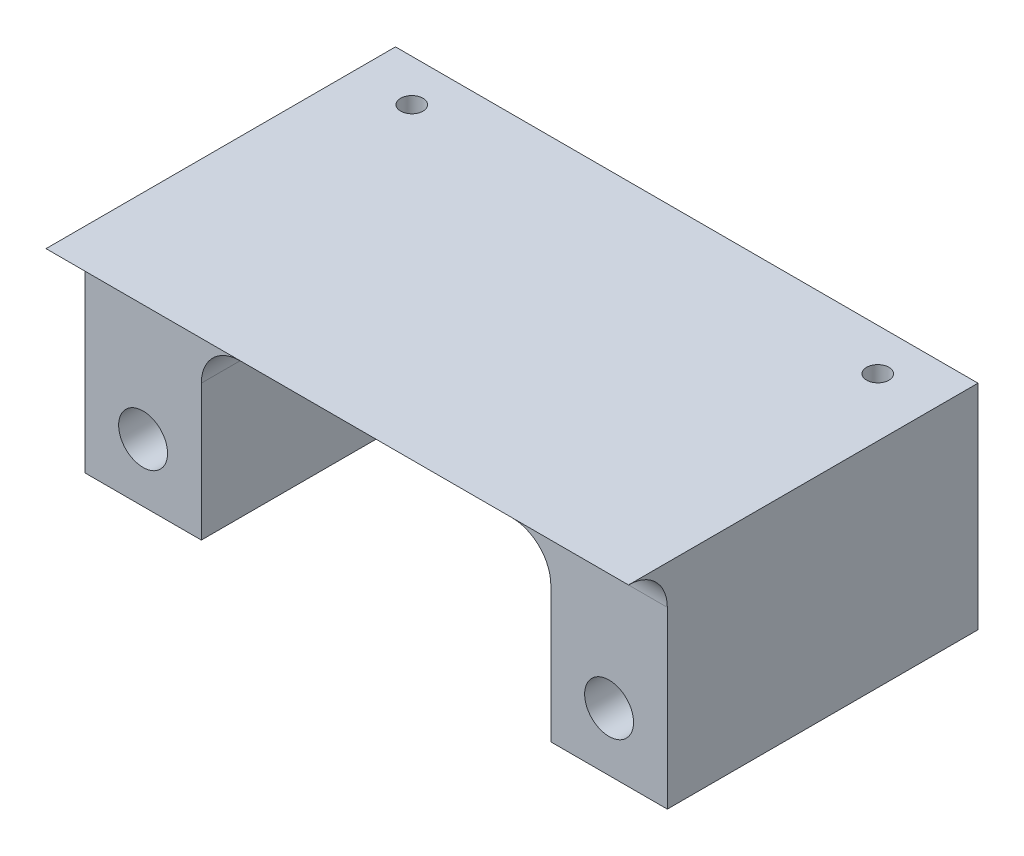
ISO-10303-21;
HEADER;
FILE_DESCRIPTION(('STEP AP214'),'2;1');
FILE_NAME('part.step','',(''),(''),'','','');
FILE_SCHEMA(('AUTOMOTIVE_DESIGN { 1 0 10303 214 1 1 1 1 }'));
ENDSEC;
DATA;
#1=APPLICATION_CONTEXT('core data for automotive mechanical design processes');
#2=APPLICATION_PROTOCOL_DEFINITION('international standard','automotive_design',2000,#1);
#3=PRODUCT_CONTEXT('',#1,'mechanical');
#4=PRODUCT('Part','Part','',(#3));
#5=PRODUCT_RELATED_PRODUCT_CATEGORY('part','',(#4));
#6=PRODUCT_DEFINITION_FORMATION('','',#4);
#7=PRODUCT_DEFINITION_CONTEXT('part definition',#1,'design');
#8=PRODUCT_DEFINITION('design','',#6,#7);
#9=PRODUCT_DEFINITION_SHAPE('','',#8);
#10=(LENGTH_UNIT() NAMED_UNIT(*) SI_UNIT(.MILLI.,.METRE.));
#11=(NAMED_UNIT(*) PLANE_ANGLE_UNIT() SI_UNIT($,.RADIAN.));
#12=(NAMED_UNIT(*) SI_UNIT($,.STERADIAN.) SOLID_ANGLE_UNIT());
#13=UNCERTAINTY_MEASURE_WITH_UNIT(LENGTH_MEASURE(1.E-05),#10,'distance_accuracy_value','');
#14=(GEOMETRIC_REPRESENTATION_CONTEXT(3) GLOBAL_UNCERTAINTY_ASSIGNED_CONTEXT((#13)) GLOBAL_UNIT_ASSIGNED_CONTEXT((#10,
#11,#12)) REPRESENTATION_CONTEXT('',''));
#15=CARTESIAN_POINT('',(0.,0.,0.));
#16=DIRECTION('',(0.,0.,1.));
#17=DIRECTION('',(1.,0.,0.));
#18=AXIS2_PLACEMENT_3D('',#15,#16,#17);
#19=CARTESIAN_POINT('',(-47.625,-6.35,31.7500000000001));
#20=DIRECTION('',(0.,-1.,0.));
#21=DIRECTION('',(0.,0.,-1.));
#22=AXIS2_PLACEMENT_3D('',#19,#20,#21);
#23=PLANE('',#22);
#24=DIRECTION('',(1.,0.,0.));
#25=VECTOR('',#24,1.);
#26=CARTESIAN_POINT('',(47.625,-6.35,31.75));
#27=LINE('',#26,#25);
#28=CARTESIAN_POINT('',(-47.625,-6.35,31.7500000000001));
#29=VERTEX_POINT('',#28);
#30=CARTESIAN_POINT('',(47.625,-6.35,31.7500000000001));
#31=VERTEX_POINT('',#30);
#32=EDGE_CURVE('E11',#29,#31,#27,.T.);
#33=ORIENTED_EDGE('',*,*,#32,.T.);
#34=DIRECTION('',(0.,0.,1.));
#35=VECTOR('',#34,1.);
#36=CARTESIAN_POINT('',(47.625,-6.35,25.4));
#37=LINE('',#36,#35);
#38=CARTESIAN_POINT('',(47.625,-6.35,-25.4));
#39=VERTEX_POINT('',#38);
#40=EDGE_CURVE('E53',#39,#31,#37,.T.);
#41=ORIENTED_EDGE('',*,*,#40,.F.);
#42=DIRECTION('',(-1.,0.,0.));
#43=VECTOR('',#42,1.);
#44=CARTESIAN_POINT('',(0.,-6.35,-25.4));
#45=LINE('',#44,#43);
#46=CARTESIAN_POINT('',(-47.625,-6.35,-25.4));
#47=VERTEX_POINT('',#46);
#48=EDGE_CURVE('E208',#39,#47,#45,.T.);
#49=ORIENTED_EDGE('',*,*,#48,.T.);
#50=DIRECTION('',(0.,0.,-1.));
#51=VECTOR('',#50,1.);
#52=CARTESIAN_POINT('',(-47.625,-6.35,25.4));
#53=LINE('',#52,#51);
#54=EDGE_CURVE('E59',#29,#47,#53,.T.);
#55=ORIENTED_EDGE('',*,*,#54,.F.);
#56=EDGE_LOOP('',(#33,#41,#49,#55));
#57=FACE_BOUND('',#56,.T.);
#58=CARTESIAN_POINT('',(38.1,-6.35,-18.542));
#59=DIRECTION('',(0.,-1.,0.));
#60=DIRECTION('',(0.,0.,-1.));
#61=AXIS2_PLACEMENT_3D('',#58,#59,#60);
#62=CIRCLE('',#61,1.8288);
#63=CARTESIAN_POINT('',(38.1,-6.35,-20.3708));
#64=VERTEX_POINT('',#63);
#65=EDGE_CURVE('E45',#64,#64,#62,.T.);
#66=ORIENTED_EDGE('',*,*,#65,.T.);
#67=EDGE_LOOP('',(#66));
#68=FACE_BOUND('',#67,.T.);
#69=CARTESIAN_POINT('',(-38.1,-6.35,-18.542));
#70=DIRECTION('',(0.,-1.,0.));
#71=DIRECTION('',(0.,0.,-1.));
#72=AXIS2_PLACEMENT_3D('',#69,#70,#71);
#73=CIRCLE('',#72,1.8288);
#74=CARTESIAN_POINT('',(-38.1,-6.35,-20.3708));
#75=VERTEX_POINT('',#74);
#76=EDGE_CURVE('E40',#75,#75,#73,.F.);
#77=ORIENTED_EDGE('',*,*,#76,.F.);
#78=EDGE_LOOP('',(#77));
#79=FACE_BOUND('',#78,.T.);
#80=ADVANCED_FACE('F37',(#57,#68,#79),#23,.F.);
#81=CARTESIAN_POINT('',(38.1,-31.75,-36.7151227125471));
#82=DIRECTION('',(0.,0.,1.));
#83=DIRECTION('',(1.,0.,0.));
#84=AXIS2_PLACEMENT_3D('',#81,#82,#83);
#85=CYLINDRICAL_SURFACE('',#84,4.00000000000001);
#86=CARTESIAN_POINT('',(38.1,-31.75,25.4));
#87=DIRECTION('',(0.,0.,1.));
#88=DIRECTION('',(1.,0.,0.));
#89=AXIS2_PLACEMENT_3D('',#86,#87,#88);
#90=CIRCLE('',#89,4.00000000000001);
#91=CARTESIAN_POINT('',(42.1,-31.75,25.4));
#92=VERTEX_POINT('',#91);
#93=EDGE_CURVE('E228',#92,#92,#90,.T.);
#94=ORIENTED_EDGE('',*,*,#93,.T.);
#95=EDGE_LOOP('',(#94));
#96=FACE_BOUND('',#95,.T.);
#97=CARTESIAN_POINT('',(38.1,-31.75,-25.4));
#98=DIRECTION('',(0.,0.,-1.));
#99=DIRECTION('',(-1.,0.,0.));
#100=AXIS2_PLACEMENT_3D('',#97,#98,#99);
#101=CIRCLE('',#100,4.00000000000001);
#102=CARTESIAN_POINT('',(34.1,-31.75,-25.4));
#103=VERTEX_POINT('',#102);
#104=EDGE_CURVE('E234',#103,#103,#101,.F.);
#105=ORIENTED_EDGE('',*,*,#104,.F.);
#106=EDGE_LOOP('',(#105));
#107=FACE_BOUND('',#106,.T.);
#108=ADVANCED_FACE('F279',(#96,#107),#85,.F.);
#109=CARTESIAN_POINT('',(-38.1,-31.75,-36.7151227125471));
#110=DIRECTION('',(0.,0.,1.));
#111=DIRECTION('',(1.,0.,0.));
#112=AXIS2_PLACEMENT_3D('',#109,#110,#111);
#113=CYLINDRICAL_SURFACE('',#112,4.00049999999999);
#114=CARTESIAN_POINT('',(-38.1,-31.75,25.4));
#115=DIRECTION('',(0.,0.,1.));
#116=DIRECTION('',(1.,0.,0.));
#117=AXIS2_PLACEMENT_3D('',#114,#115,#116);
#118=CIRCLE('',#117,4.00049999999999);
#119=CARTESIAN_POINT('',(-34.0995,-31.75,25.4));
#120=VERTEX_POINT('',#119);
#121=EDGE_CURVE('E231',#120,#120,#118,.T.);
#122=ORIENTED_EDGE('',*,*,#121,.T.);
#123=EDGE_LOOP('',(#122));
#124=FACE_BOUND('',#123,.T.);
#125=CARTESIAN_POINT('',(-38.1,-31.75,-25.4));
#126=DIRECTION('',(0.,0.,-1.));
#127=DIRECTION('',(-1.,0.,0.));
#128=AXIS2_PLACEMENT_3D('',#125,#126,#127);
#129=CIRCLE('',#128,4.00049999999999);
#130=CARTESIAN_POINT('',(-42.1005,-31.75,-25.4));
#131=VERTEX_POINT('',#130);
#132=EDGE_CURVE('E162',#131,#131,#129,.F.);
#133=ORIENTED_EDGE('',*,*,#132,.F.);
#134=EDGE_LOOP('',(#133));
#135=FACE_BOUND('',#134,.T.);
#136=ADVANCED_FACE('F275',(#124,#135),#113,.F.);
#137=CARTESIAN_POINT('',(-47.625,-41.275,25.4));
#138=DIRECTION('',(0.,1.,0.));
#139=DIRECTION('',(0.,0.,1.));
#140=AXIS2_PLACEMENT_3D('',#137,#138,#139);
#141=PLANE('',#140);
#142=DIRECTION('',(1.,0.,0.));
#143=VECTOR('',#142,1.);
#144=CARTESIAN_POINT('',(-47.625,-41.275,-25.4));
#145=LINE('',#144,#143);
#146=CARTESIAN_POINT('',(-47.625,-41.275,-25.4));
#147=VERTEX_POINT('',#146);
#148=CARTESIAN_POINT('',(-28.575,-41.275,-25.4));
#149=VERTEX_POINT('',#148);
#150=EDGE_CURVE('E164',#147,#149,#145,.T.);
#151=ORIENTED_EDGE('',*,*,#150,.T.);
#152=DIRECTION('',(0.,0.,-1.));
#153=VECTOR('',#152,1.);
#154=CARTESIAN_POINT('',(-28.575,-41.275,25.4));
#155=LINE('',#154,#153);
#156=CARTESIAN_POINT('',(-28.575,-41.275,25.4));
#157=VERTEX_POINT('',#156);
#158=EDGE_CURVE('E142',#157,#149,#155,.T.);
#159=ORIENTED_EDGE('',*,*,#158,.F.);
#160=DIRECTION('',(1.,0.,0.));
#161=VECTOR('',#160,1.);
#162=CARTESIAN_POINT('',(-47.625,-41.275,25.4));
#163=LINE('',#162,#161);
#164=CARTESIAN_POINT('',(-47.625,-41.275,25.4));
#165=VERTEX_POINT('',#164);
#166=EDGE_CURVE('E125',#165,#157,#163,.T.);
#167=ORIENTED_EDGE('',*,*,#166,.F.);
#168=DIRECTION('',(0.,0.,-1.));
#169=VECTOR('',#168,1.);
#170=CARTESIAN_POINT('',(-47.625,-41.275,25.4));
#171=LINE('',#170,#169);
#172=EDGE_CURVE('E135',#165,#147,#171,.T.);
#173=ORIENTED_EDGE('',*,*,#172,.T.);
#174=EDGE_LOOP('',(#151,#159,#167,#173));
#175=FACE_BOUND('',#174,.T.);
#176=ADVANCED_FACE('F144',(#175),#141,.F.);
#177=CARTESIAN_POINT('',(-28.575,-41.275,25.4));
#178=DIRECTION('',(-1.,0.,0.));
#179=DIRECTION('',(0.,-1.,0.));
#180=AXIS2_PLACEMENT_3D('',#177,#178,#179);
#181=PLANE('',#180);
#182=DIRECTION('',(0.,1.,0.));
#183=VECTOR('',#182,1.);
#184=CARTESIAN_POINT('',(-28.575,-41.275,-25.4));
#185=LINE('',#184,#183);
#186=CARTESIAN_POINT('',(-28.575,-19.05,-25.4));
#187=VERTEX_POINT('',#186);
#188=EDGE_CURVE('E166',#149,#187,#185,.T.);
#189=ORIENTED_EDGE('',*,*,#188,.T.);
#190=DIRECTION('',(0.,0.,-1.));
#191=VECTOR('',#190,1.);
#192=CARTESIAN_POINT('',(-28.575,-19.05,25.4));
#193=LINE('',#192,#191);
#194=CARTESIAN_POINT('',(-28.575,-19.05,25.4));
#195=VERTEX_POINT('',#194);
#196=EDGE_CURVE('E190',#187,#195,#193,.F.);
#197=ORIENTED_EDGE('',*,*,#196,.T.);
#198=DIRECTION('',(0.,1.,0.));
#199=VECTOR('',#198,1.);
#200=CARTESIAN_POINT('',(-28.575,-41.275,25.4));
#201=LINE('',#200,#199);
#202=EDGE_CURVE('E147',#157,#195,#201,.T.);
#203=ORIENTED_EDGE('',*,*,#202,.F.);
#204=ORIENTED_EDGE('',*,*,#158,.T.);
#205=EDGE_LOOP('',(#189,#197,#203,#204));
#206=FACE_BOUND('',#205,.T.);
#207=ADVANCED_FACE('F266',(#206),#181,.F.);
#208=CARTESIAN_POINT('',(-22.225,-19.05,25.4));
#209=DIRECTION('',(0.,0.,1.));
#210=DIRECTION('',(1.,0.,0.));
#211=AXIS2_PLACEMENT_3D('',#208,#209,#210);
#212=CYLINDRICAL_SURFACE('',#211,6.35);
#213=CARTESIAN_POINT('',(-22.225,-19.05,25.4));
#214=DIRECTION('',(0.,0.,-1.));
#215=DIRECTION('',(-1.,0.,0.));
#216=AXIS2_PLACEMENT_3D('',#213,#214,#215);
#217=CIRCLE('',#216,6.35);
#218=CARTESIAN_POINT('',(-22.225,-12.7,25.4));
#219=VERTEX_POINT('',#218);
#220=EDGE_CURVE('E198',#195,#219,#217,.T.);
#221=ORIENTED_EDGE('',*,*,#220,.F.);
#222=ORIENTED_EDGE('',*,*,#196,.F.);
#223=CARTESIAN_POINT('',(-22.225,-19.05,-25.4));
#224=DIRECTION('',(0.,0.,-1.));
#225=DIRECTION('',(-1.,0.,0.));
#226=AXIS2_PLACEMENT_3D('',#223,#224,#225);
#227=CIRCLE('',#226,6.35);
#228=CARTESIAN_POINT('',(-22.225,-12.7,-25.4));
#229=VERTEX_POINT('',#228);
#230=EDGE_CURVE('E196',#229,#187,#227,.F.);
#231=ORIENTED_EDGE('',*,*,#230,.F.);
#232=DIRECTION('',(0.,0.,-1.));
#233=VECTOR('',#232,1.);
#234=CARTESIAN_POINT('',(-22.225,-12.7,-25.4));
#235=LINE('',#234,#233);
#236=EDGE_CURVE('E184',#219,#229,#235,.T.);
#237=ORIENTED_EDGE('',*,*,#236,.F.);
#238=EDGE_LOOP('',(#221,#222,#231,#237));
#239=FACE_BOUND('',#238,.T.);
#240=ADVANCED_FACE('F259',(#239),#212,.F.);
#241=CARTESIAN_POINT('',(22.225,-19.05,25.4));
#242=DIRECTION('',(0.,0.,1.));
#243=DIRECTION('',(1.,0.,0.));
#244=AXIS2_PLACEMENT_3D('',#241,#242,#243);
#245=CYLINDRICAL_SURFACE('',#244,6.35);
#246=CARTESIAN_POINT('',(22.225,-19.05,25.4));
#247=DIRECTION('',(0.,0.,-1.));
#248=DIRECTION('',(-1.,0.,0.));
#249=AXIS2_PLACEMENT_3D('',#246,#247,#248);
#250=CIRCLE('',#249,6.35);
#251=CARTESIAN_POINT('',(22.225,-12.7,25.4));
#252=VERTEX_POINT('',#251);
#253=CARTESIAN_POINT('',(28.575,-19.05,25.4));
#254=VERTEX_POINT('',#253);
#255=EDGE_CURVE('E194',#252,#254,#250,.T.);
#256=ORIENTED_EDGE('',*,*,#255,.F.);
#257=DIRECTION('',(0.,0.,-1.));
#258=VECTOR('',#257,1.);
#259=CARTESIAN_POINT('',(22.225,-12.7,25.4));
#260=LINE('',#259,#258);
#261=CARTESIAN_POINT('',(22.225,-12.7,-25.4));
#262=VERTEX_POINT('',#261);
#263=EDGE_CURVE('E187',#262,#252,#260,.F.);
#264=ORIENTED_EDGE('',*,*,#263,.F.);
#265=CARTESIAN_POINT('',(22.225,-19.05,-25.4));
#266=DIRECTION('',(0.,0.,-1.));
#267=DIRECTION('',(-1.,0.,0.));
#268=AXIS2_PLACEMENT_3D('',#265,#266,#267);
#269=CIRCLE('',#268,6.35);
#270=CARTESIAN_POINT('',(28.575,-19.05,-25.4));
#271=VERTEX_POINT('',#270);
#272=EDGE_CURVE('E192',#271,#262,#269,.F.);
#273=ORIENTED_EDGE('',*,*,#272,.F.);
#274=DIRECTION('',(0.,0.,-1.));
#275=VECTOR('',#274,1.);
#276=CARTESIAN_POINT('',(28.575,-19.05,-25.4));
#277=LINE('',#276,#275);
#278=EDGE_CURVE('E141',#254,#271,#277,.T.);
#279=ORIENTED_EDGE('',*,*,#278,.F.);
#280=EDGE_LOOP('',(#256,#264,#273,#279));
#281=FACE_BOUND('',#280,.T.);
#282=ADVANCED_FACE('F273',(#281),#245,.F.);
#283=CARTESIAN_POINT('',(28.575,-41.275,25.4));
#284=DIRECTION('',(1.,0.,0.));
#285=DIRECTION('',(0.,1.,0.));
#286=AXIS2_PLACEMENT_3D('',#283,#284,#285);
#287=PLANE('',#286);
#288=DIRECTION('',(0.,-1.,0.));
#289=VECTOR('',#288,1.);
#290=CARTESIAN_POINT('',(28.575,-41.275,25.4));
#291=LINE('',#290,#289);
#292=CARTESIAN_POINT('',(28.575,-41.275,25.4));
#293=VERTEX_POINT('',#292);
#294=EDGE_CURVE('E155',#254,#293,#291,.T.);
#295=ORIENTED_EDGE('',*,*,#294,.F.);
#296=ORIENTED_EDGE('',*,*,#278,.T.);
#297=DIRECTION('',(0.,-1.,0.));
#298=VECTOR('',#297,1.);
#299=CARTESIAN_POINT('',(28.575,-41.275,-25.4));
#300=LINE('',#299,#298);
#301=CARTESIAN_POINT('',(28.575,-41.275,-25.4));
#302=VERTEX_POINT('',#301);
#303=EDGE_CURVE('E172',#271,#302,#300,.T.);
#304=ORIENTED_EDGE('',*,*,#303,.T.);
#305=DIRECTION('',(0.,0.,-1.));
#306=VECTOR('',#305,1.);
#307=CARTESIAN_POINT('',(28.575,-41.275,25.4));
#308=LINE('',#307,#306);
#309=EDGE_CURVE('E178',#293,#302,#308,.T.);
#310=ORIENTED_EDGE('',*,*,#309,.F.);
#311=EDGE_LOOP('',(#295,#296,#304,#310));
#312=FACE_BOUND('',#311,.T.);
#313=ADVANCED_FACE('F307',(#312),#287,.F.);
#314=CARTESIAN_POINT('',(47.625,-41.275,25.4));
#315=DIRECTION('',(0.,1.,0.));
#316=DIRECTION('',(-1.,0.,0.));
#317=AXIS2_PLACEMENT_3D('',#314,#315,#316);
#318=PLANE('',#317);
#319=DIRECTION('',(1.,0.,0.));
#320=VECTOR('',#319,1.);
#321=CARTESIAN_POINT('',(47.625,-41.275,-25.4));
#322=LINE('',#321,#320);
#323=CARTESIAN_POINT('',(47.625,-41.275,-25.4));
#324=VERTEX_POINT('',#323);
#325=EDGE_CURVE('E174',#302,#324,#322,.T.);
#326=ORIENTED_EDGE('',*,*,#325,.T.);
#327=DIRECTION('',(0.,0.,-1.));
#328=VECTOR('',#327,1.);
#329=CARTESIAN_POINT('',(47.625,-41.275,25.4));
#330=LINE('',#329,#328);
#331=CARTESIAN_POINT('',(47.625,-41.275,25.4));
#332=VERTEX_POINT('',#331);
#333=EDGE_CURVE('E159',#332,#324,#330,.T.);
#334=ORIENTED_EDGE('',*,*,#333,.F.);
#335=DIRECTION('',(1.,0.,0.));
#336=VECTOR('',#335,1.);
#337=CARTESIAN_POINT('',(47.625,-41.275,25.4));
#338=LINE('',#337,#336);
#339=EDGE_CURVE('E157',#293,#332,#338,.T.);
#340=ORIENTED_EDGE('',*,*,#339,.F.);
#341=ORIENTED_EDGE('',*,*,#309,.T.);
#342=EDGE_LOOP('',(#326,#334,#340,#341));
#343=FACE_BOUND('',#342,.T.);
#344=ADVANCED_FACE('F301',(#343),#318,.F.);
#345=CARTESIAN_POINT('',(0.,0.,25.4));
#346=DIRECTION('',(0.,0.,-1.));
#347=DIRECTION('',(-1.,0.,0.));
#348=AXIS2_PLACEMENT_3D('',#345,#346,#347);
#349=PLANE('',#348);
#350=ORIENTED_EDGE('',*,*,#121,.F.);
#351=EDGE_LOOP('',(#350));
#352=FACE_BOUND('',#351,.T.);
#353=ORIENTED_EDGE('',*,*,#220,.T.);
#354=DIRECTION('',(1.,0.,0.));
#355=VECTOR('',#354,1.);
#356=CARTESIAN_POINT('',(-47.625,-12.7,25.4));
#357=LINE('',#356,#355);
#358=CARTESIAN_POINT('',(-47.625,-12.7,25.4));
#359=VERTEX_POINT('',#358);
#360=EDGE_CURVE('E128',#219,#359,#357,.F.);
#361=ORIENTED_EDGE('',*,*,#360,.T.);
#362=DIRECTION('',(0.,-1.,0.));
#363=VECTOR('',#362,1.);
#364=CARTESIAN_POINT('',(-47.625,0.,25.4));
#365=LINE('',#364,#363);
#366=EDGE_CURVE('E120',#359,#165,#365,.T.);
#367=ORIENTED_EDGE('',*,*,#366,.T.);
#368=ORIENTED_EDGE('',*,*,#166,.T.);
#369=ORIENTED_EDGE('',*,*,#202,.T.);
#370=EDGE_LOOP('',(#353,#361,#367,#368,#369));
#371=FACE_BOUND('',#370,.T.);
#372=ADVANCED_FACE('F122',(#352,#371),#349,.F.);
#373=CARTESIAN_POINT('',(-47.625,0.,25.4));
#374=DIRECTION('',(1.,0.,0.));
#375=DIRECTION('',(0.,0.,-1.));
#376=AXIS2_PLACEMENT_3D('',#373,#374,#375);
#377=PLANE('',#376);
#378=CARTESIAN_POINT('',(-47.625,-12.7,31.75));
#379=DIRECTION('',(1.,0.,0.));
#380=DIRECTION('',(0.,0.,-1.));
#381=AXIS2_PLACEMENT_3D('',#378,#379,#380);
#382=CIRCLE('',#381,6.35);
#383=EDGE_CURVE('E205',#359,#29,#382,.T.);
#384=ORIENTED_EDGE('',*,*,#383,.T.);
#385=ORIENTED_EDGE('',*,*,#54,.T.);
#386=DIRECTION('',(0.,-1.,0.));
#387=VECTOR('',#386,1.);
#388=CARTESIAN_POINT('',(-47.625,0.,-25.4));
#389=LINE('',#388,#387);
#390=EDGE_CURVE('E138',#47,#147,#389,.T.);
#391=ORIENTED_EDGE('',*,*,#390,.T.);
#392=ORIENTED_EDGE('',*,*,#172,.F.);
#393=ORIENTED_EDGE('',*,*,#366,.F.);
#394=EDGE_LOOP('',(#384,#385,#391,#392,#393));
#395=FACE_BOUND('',#394,.T.);
#396=ADVANCED_FACE('F136',(#395),#377,.F.);
#397=CARTESIAN_POINT('',(47.625,0.,25.4));
#398=DIRECTION('',(-1.,0.,0.));
#399=DIRECTION('',(0.,-1.,0.));
#400=AXIS2_PLACEMENT_3D('',#397,#398,#399);
#401=PLANE('',#400);
#402=DIRECTION('',(0.,1.,0.));
#403=VECTOR('',#402,1.);
#404=CARTESIAN_POINT('',(47.625,0.,-25.4));
#405=LINE('',#404,#403);
#406=EDGE_CURVE('E160',#324,#39,#405,.T.);
#407=ORIENTED_EDGE('',*,*,#406,.T.);
#408=ORIENTED_EDGE('',*,*,#40,.T.);
#409=CARTESIAN_POINT('',(47.625,-12.7,31.75));
#410=DIRECTION('',(-1.,0.,0.));
#411=DIRECTION('',(0.,-1.,0.));
#412=AXIS2_PLACEMENT_3D('',#409,#410,#411);
#413=CIRCLE('',#412,6.35);
#414=CARTESIAN_POINT('',(47.625,-12.7,25.4));
#415=VERTEX_POINT('',#414);
#416=EDGE_CURVE('E203',#31,#415,#413,.T.);
#417=ORIENTED_EDGE('',*,*,#416,.T.);
#418=DIRECTION('',(0.,1.,0.));
#419=VECTOR('',#418,1.);
#420=CARTESIAN_POINT('',(47.625,0.,25.4));
#421=LINE('',#420,#419);
#422=EDGE_CURVE('E132',#332,#415,#421,.T.);
#423=ORIENTED_EDGE('',*,*,#422,.F.);
#424=ORIENTED_EDGE('',*,*,#333,.T.);
#425=EDGE_LOOP('',(#407,#408,#417,#423,#424));
#426=FACE_BOUND('',#425,.T.);
#427=ADVANCED_FACE('F316',(#426),#401,.F.);
#428=ORIENTED_EDGE('',*,*,#93,.F.);
#429=EDGE_LOOP('',(#428));
#430=FACE_BOUND('',#429,.T.);
#431=ORIENTED_EDGE('',*,*,#422,.T.);
#432=DIRECTION('',(1.,0.,0.));
#433=VECTOR('',#432,1.);
#434=CARTESIAN_POINT('',(-47.625,-12.7,25.4));
#435=LINE('',#434,#433);
#436=EDGE_CURVE('E201',#415,#252,#435,.F.);
#437=ORIENTED_EDGE('',*,*,#436,.T.);
#438=ORIENTED_EDGE('',*,*,#255,.T.);
#439=ORIENTED_EDGE('',*,*,#294,.T.);
#440=ORIENTED_EDGE('',*,*,#339,.T.);
#441=EDGE_LOOP('',(#431,#437,#438,#439,#440));
#442=FACE_BOUND('',#441,.T.);
#443=ADVANCED_FACE('F244',(#430,#442),#349,.F.);
#444=CARTESIAN_POINT('',(-28.575,-12.7,25.4));
#445=DIRECTION('',(0.,1.,0.));
#446=DIRECTION('',(0.,0.,1.));
#447=AXIS2_PLACEMENT_3D('',#444,#445,#446);
#448=PLANE('',#447);
#449=DIRECTION('',(1.,0.,0.));
#450=VECTOR('',#449,1.);
#451=CARTESIAN_POINT('',(-28.575,-12.7,-25.4));
#452=LINE('',#451,#450);
#453=EDGE_CURVE('E169',#229,#262,#452,.T.);
#454=ORIENTED_EDGE('',*,*,#453,.T.);
#455=ORIENTED_EDGE('',*,*,#263,.T.);
#456=DIRECTION('',(1.,0.,0.));
#457=VECTOR('',#456,1.);
#458=CARTESIAN_POINT('',(-28.575,-12.7,25.4));
#459=LINE('',#458,#457);
#460=EDGE_CURVE('E149',#219,#252,#459,.T.);
#461=ORIENTED_EDGE('',*,*,#460,.F.);
#462=ORIENTED_EDGE('',*,*,#236,.T.);
#463=EDGE_LOOP('',(#454,#455,#461,#462));
#464=FACE_BOUND('',#463,.T.);
#465=ADVANCED_FACE('F253',(#464),#448,.F.);
#466=CARTESIAN_POINT('',(-47.625,-12.7,31.75));
#467=DIRECTION('',(-1.,0.,0.));
#468=DIRECTION('',(0.,0.,1.));
#469=AXIS2_PLACEMENT_3D('',#466,#467,#468);
#470=CYLINDRICAL_SURFACE('',#469,6.35);
#471=ORIENTED_EDGE('',*,*,#460,.T.);
#472=ORIENTED_EDGE('',*,*,#436,.F.);
#473=ORIENTED_EDGE('',*,*,#416,.F.);
#474=ORIENTED_EDGE('',*,*,#32,.F.);
#475=ORIENTED_EDGE('',*,*,#383,.F.);
#476=ORIENTED_EDGE('',*,*,#360,.F.);
#477=EDGE_LOOP('',(#471,#472,#473,#474,#475,#476));
#478=FACE_BOUND('',#477,.T.);
#479=ADVANCED_FACE('F249',(#478),#470,.F.);
#480=CARTESIAN_POINT('',(0.,0.,-25.4));
#481=DIRECTION('',(0.,0.,-1.));
#482=DIRECTION('',(-1.,0.,0.));
#483=AXIS2_PLACEMENT_3D('',#480,#481,#482);
#484=PLANE('',#483);
#485=ORIENTED_EDGE('',*,*,#48,.F.);
#486=ORIENTED_EDGE('',*,*,#406,.F.);
#487=ORIENTED_EDGE('',*,*,#325,.F.);
#488=ORIENTED_EDGE('',*,*,#303,.F.);
#489=ORIENTED_EDGE('',*,*,#272,.T.);
#490=ORIENTED_EDGE('',*,*,#453,.F.);
#491=ORIENTED_EDGE('',*,*,#230,.T.);
#492=ORIENTED_EDGE('',*,*,#188,.F.);
#493=ORIENTED_EDGE('',*,*,#150,.F.);
#494=ORIENTED_EDGE('',*,*,#390,.F.);
#495=EDGE_LOOP('',(#485,#486,#487,#488,#489,#490,#491,#492,#493,#494));
#496=FACE_BOUND('',#495,.T.);
#497=ORIENTED_EDGE('',*,*,#132,.T.);
#498=EDGE_LOOP('',(#497));
#499=FACE_BOUND('',#498,.T.);
#500=ORIENTED_EDGE('',*,*,#104,.T.);
#501=EDGE_LOOP('',(#500));
#502=FACE_BOUND('',#501,.T.);
#503=ADVANCED_FACE('F263',(#496,#499,#502),#484,.T.);
#504=CARTESIAN_POINT('',(38.1,-12.7,-18.542));
#505=DIRECTION('',(0.,1.,0.));
#506=DIRECTION('',(1.,0.,0.));
#507=AXIS2_PLACEMENT_3D('',#504,#505,#506);
#508=PLANE('',#507);
#509=CARTESIAN_POINT('',(38.1,-12.7,-18.542));
#510=DIRECTION('',(0.,-1.,0.));
#511=DIRECTION('',(1.,0.,0.));
#512=AXIS2_PLACEMENT_3D('',#509,#510,#511);
#513=CIRCLE('',#512,1.8288);
#514=CARTESIAN_POINT('',(39.9288,-12.7,-18.542));
#515=VERTEX_POINT('',#514);
#516=EDGE_CURVE('E223',#515,#515,#513,.T.);
#517=ORIENTED_EDGE('',*,*,#516,.F.);
#518=EDGE_LOOP('',(#517));
#519=FACE_BOUND('',#518,.T.);
#520=ADVANCED_FACE('F219',(#519),#508,.T.);
#521=CARTESIAN_POINT('',(38.1,-12.7,-18.542));
#522=DIRECTION('',(0.,1.,0.));
#523=DIRECTION('',(-1.,0.,0.));
#524=AXIS2_PLACEMENT_3D('',#521,#522,#523);
#525=CYLINDRICAL_SURFACE('',#524,1.8288);
#526=ORIENTED_EDGE('',*,*,#65,.F.);
#527=EDGE_LOOP('',(#526));
#528=FACE_BOUND('',#527,.T.);
#529=ORIENTED_EDGE('',*,*,#516,.T.);
#530=EDGE_LOOP('',(#529));
#531=FACE_BOUND('',#530,.T.);
#532=ADVANCED_FACE('F215',(#528,#531),#525,.F.);
#533=CARTESIAN_POINT('',(-38.1,-12.7,-18.542));
#534=DIRECTION('',(0.,1.,0.));
#535=DIRECTION('',(-1.,0.,0.));
#536=AXIS2_PLACEMENT_3D('',#533,#534,#535);
#537=CYLINDRICAL_SURFACE('',#536,1.8288);
#538=ORIENTED_EDGE('',*,*,#76,.T.);
#539=EDGE_LOOP('',(#538));
#540=FACE_BOUND('',#539,.T.);
#541=CARTESIAN_POINT('',(-38.1,-12.7,-18.542));
#542=DIRECTION('',(0.,1.,0.));
#543=DIRECTION('',(-1.,0.,0.));
#544=AXIS2_PLACEMENT_3D('',#541,#542,#543);
#545=CIRCLE('',#544,1.8288);
#546=CARTESIAN_POINT('',(-39.9288,-12.7,-18.542));
#547=VERTEX_POINT('',#546);
#548=EDGE_CURVE('E225',#547,#547,#545,.T.);
#549=ORIENTED_EDGE('',*,*,#548,.F.);
#550=EDGE_LOOP('',(#549));
#551=FACE_BOUND('',#550,.T.);
#552=ADVANCED_FACE('F218',(#540,#551),#537,.F.);
#553=CARTESIAN_POINT('',(-38.1,-12.7,-18.542));
#554=DIRECTION('',(0.,1.,0.));
#555=DIRECTION('',(-1.,0.,0.));
#556=AXIS2_PLACEMENT_3D('',#553,#554,#555);
#557=PLANE('',#556);
#558=ORIENTED_EDGE('',*,*,#548,.T.);
#559=EDGE_LOOP('',(#558));
#560=FACE_BOUND('',#559,.T.);
#561=ADVANCED_FACE('F280',(#560),#557,.T.);
#562=CLOSED_SHELL('',(#80,#108,#136,#176,#207,#240,#282,#313,#344,#372,#396,#427,#443,#465,#479,
#503,#520,#532,#552,#561));
#563=MANIFOLD_SOLID_BREP('B2',#562);
#564=ADVANCED_BREP_SHAPE_REPRESENTATION('',(#18,#563),#14);
#565=SHAPE_DEFINITION_REPRESENTATION(#9,#564);
ENDSEC;
END-ISO-10303-21;
